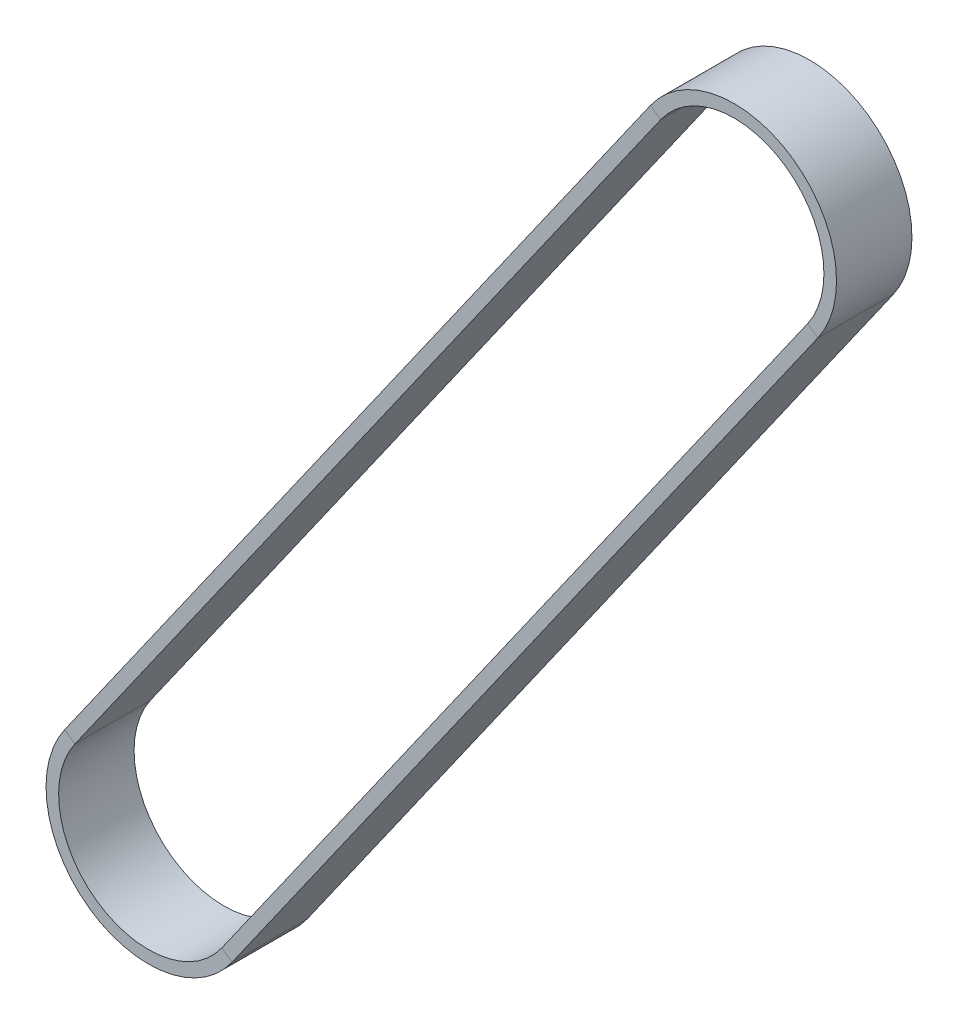
ISO-10303-21;
HEADER;
FILE_DESCRIPTION(('STEP AP214'),'2;1');
FILE_NAME('part.step','',(''),(''),'','','');
FILE_SCHEMA(('AUTOMOTIVE_DESIGN { 1 0 10303 214 1 1 1 1 }'));
ENDSEC;
DATA;
#1=APPLICATION_CONTEXT('core data for automotive mechanical design processes');
#2=APPLICATION_PROTOCOL_DEFINITION('international standard','automotive_design',2000,#1);
#3=PRODUCT_CONTEXT('',#1,'mechanical');
#4=PRODUCT('Part','Part','',(#3));
#5=PRODUCT_RELATED_PRODUCT_CATEGORY('part','',(#4));
#6=PRODUCT_DEFINITION_FORMATION('','',#4);
#7=PRODUCT_DEFINITION_CONTEXT('part definition',#1,'design');
#8=PRODUCT_DEFINITION('design','',#6,#7);
#9=PRODUCT_DEFINITION_SHAPE('','',#8);
#10=(LENGTH_UNIT() NAMED_UNIT(*) SI_UNIT(.MILLI.,.METRE.));
#11=(NAMED_UNIT(*) PLANE_ANGLE_UNIT() SI_UNIT($,.RADIAN.));
#12=(NAMED_UNIT(*) SI_UNIT($,.STERADIAN.) SOLID_ANGLE_UNIT());
#13=UNCERTAINTY_MEASURE_WITH_UNIT(LENGTH_MEASURE(1.E-05),#10,'distance_accuracy_value','');
#14=(GEOMETRIC_REPRESENTATION_CONTEXT(3) GLOBAL_UNCERTAINTY_ASSIGNED_CONTEXT((#13)) GLOBAL_UNIT_ASSIGNED_CONTEXT((#10,
#11,#12)) REPRESENTATION_CONTEXT('',''));
#15=CARTESIAN_POINT('',(0.,0.,0.));
#16=DIRECTION('',(0.,0.,1.));
#17=DIRECTION('',(1.,0.,0.));
#18=AXIS2_PLACEMENT_3D('',#15,#16,#17);
#19=CARTESIAN_POINT('',(-81.6871696400104,-84.9175972484499,4.50000000000002));
#20=DIRECTION('',(0.,0.,1.));
#21=DIRECTION('',(1.,0.,0.));
#22=AXIS2_PLACEMENT_3D('',#19,#20,#21);
#23=PLANE('',#22);
#24=DIRECTION('',(0.575005551879474,0.818149506696534,0.));
#25=VECTOR('',#24,1.);
#26=CARTESIAN_POINT('',(-82.9143939000552,-84.0550889206307,4.50000000000002));
#27=LINE('',#26,#25);
#28=CARTESIAN_POINT('',(-82.9143939000552,-84.0550889206307,4.50000000000002));
#29=VERTEX_POINT('',#28);
#30=CARTESIAN_POINT('',(-13.0390177288961,15.367437275519,4.50000000000002));
#31=VERTEX_POINT('',#30);
#32=EDGE_CURVE('E11',#29,#31,#27,.T.);
#33=ORIENTED_EDGE('',*,*,#32,.F.);
#34=DIRECTION('',(0.818149506696534,-0.575005551879474,0.));
#35=VECTOR('',#34,1.);
#36=CARTESIAN_POINT('',(-81.6871696400104,-84.9175972484499,4.50000000000002));
#37=LINE('',#36,#35);
#38=CARTESIAN_POINT('',(-81.6871696400104,-84.9175972484499,4.50000000000002));
#39=VERTEX_POINT('',#38);
#40=EDGE_CURVE('E42',#29,#39,#37,.T.);
#41=ORIENTED_EDGE('',*,*,#40,.T.);
#42=DIRECTION('',(0.575005551879474,0.818149506696534,0.));
#43=VECTOR('',#42,1.);
#44=CARTESIAN_POINT('',(-81.6871696400104,-84.9175972484499,4.50000000000002));
#45=LINE('',#44,#43);
#46=CARTESIAN_POINT('',(-11.8117934688513,14.5049289476998,4.50000000000002));
#47=VERTEX_POINT('',#46);
#48=EDGE_CURVE('E128',#39,#47,#45,.T.);
#49=ORIENTED_EDGE('',*,*,#48,.T.);
#50=DIRECTION('',(0.818149506696534,-0.575005551879474,0.));
#51=VECTOR('',#50,1.);
#52=CARTESIAN_POINT('',(-11.8117934688513,14.5049289476998,4.50000000000002));
#53=LINE('',#52,#51);
#54=EDGE_CURVE('E131',#31,#47,#53,.T.);
#55=ORIENTED_EDGE('',*,*,#54,.F.);
#56=EDGE_LOOP('',(#33,#41,#49,#55));
#57=FACE_BOUND('',#56,.T.);
#58=ADVANCED_FACE('F39',(#57),#23,.T.);
#59=CARTESIAN_POINT('',(-82.9143939000552,-84.0550889206307,4.50000000000002));
#60=DIRECTION('',(-0.818149506696534,0.575005551879474,0.));
#61=DIRECTION('',(-0.575005551879474,-0.818149506696534,0.));
#62=AXIS2_PLACEMENT_3D('',#59,#60,#61);
#63=PLANE('',#62);
#64=DIRECTION('',(0.575005551879474,0.818149506696534,0.));
#65=VECTOR('',#64,1.);
#66=CARTESIAN_POINT('',(-82.9143939000552,-84.0550889206307,-4.49999999999998));
#67=LINE('',#66,#65);
#68=CARTESIAN_POINT('',(-82.9143939000552,-84.0550889206307,-4.49999999999998));
#69=VERTEX_POINT('',#68);
#70=CARTESIAN_POINT('',(-13.0390177288961,15.367437275519,-4.49999999999998));
#71=VERTEX_POINT('',#70);
#72=EDGE_CURVE('E48',#69,#71,#67,.T.);
#73=ORIENTED_EDGE('',*,*,#72,.F.);
#74=DIRECTION('',(0.,0.,1.));
#75=VECTOR('',#74,1.);
#76=CARTESIAN_POINT('',(-82.9143939000552,-84.0550889206307,4.50000000000002));
#77=LINE('',#76,#75);
#78=EDGE_CURVE('E218',#69,#29,#77,.T.);
#79=ORIENTED_EDGE('',*,*,#78,.T.);
#80=ORIENTED_EDGE('',*,*,#32,.T.);
#81=DIRECTION('',(0.,0.,1.));
#82=VECTOR('',#81,1.);
#83=CARTESIAN_POINT('',(-13.0390177288961,15.367437275519,4.50000000000002));
#84=LINE('',#83,#82);
#85=EDGE_CURVE('E159',#71,#31,#84,.T.);
#86=ORIENTED_EDGE('',*,*,#85,.F.);
#87=EDGE_LOOP('',(#73,#79,#80,#86));
#88=FACE_BOUND('',#87,.T.);
#89=ADVANCED_FACE('F252',(#88),#63,.T.);
#90=CARTESIAN_POINT('',(-81.6871696400104,-84.9175972484499,-4.49999999999998));
#91=DIRECTION('',(0.,0.,-1.));
#92=DIRECTION('',(-1.,0.,0.));
#93=AXIS2_PLACEMENT_3D('',#90,#91,#92);
#94=PLANE('',#93);
#95=DIRECTION('',(0.575005551879474,0.818149506696534,0.));
#96=VECTOR('',#95,1.);
#97=CARTESIAN_POINT('',(-81.6871696400104,-84.9175972484499,-4.49999999999998));
#98=LINE('',#97,#96);
#99=CARTESIAN_POINT('',(-81.6871696400104,-84.9175972484499,-4.49999999999998));
#100=VERTEX_POINT('',#99);
#101=CARTESIAN_POINT('',(-11.8117934688513,14.5049289476998,-4.49999999999998));
#102=VERTEX_POINT('',#101);
#103=EDGE_CURVE('E138',#100,#102,#98,.T.);
#104=ORIENTED_EDGE('',*,*,#103,.F.);
#105=DIRECTION('',(-0.818149506696533,0.575005551879475,0.));
#106=VECTOR('',#105,1.);
#107=CARTESIAN_POINT('',(-81.6871696400104,-84.9175972484499,-4.49999999999998));
#108=LINE('',#107,#106);
#109=EDGE_CURVE('E194',#100,#69,#108,.T.);
#110=ORIENTED_EDGE('',*,*,#109,.T.);
#111=ORIENTED_EDGE('',*,*,#72,.T.);
#112=DIRECTION('',(-0.818149506696533,0.575005551879475,0.));
#113=VECTOR('',#112,1.);
#114=CARTESIAN_POINT('',(-11.8117934688513,14.5049289476998,-4.49999999999998));
#115=LINE('',#114,#113);
#116=EDGE_CURVE('E164',#102,#71,#115,.T.);
#117=ORIENTED_EDGE('',*,*,#116,.F.);
#118=EDGE_LOOP('',(#104,#110,#111,#117));
#119=FACE_BOUND('',#118,.T.);
#120=ADVANCED_FACE('F257',(#119),#94,.T.);
#121=CARTESIAN_POINT('',(-64.1699341820323,-97.2289261186309,4.50000000000002));
#122=DIRECTION('',(0.,0.,1.));
#123=DIRECTION('',(1.,0.,0.));
#124=AXIS2_PLACEMENT_3D('',#121,#122,#123);
#125=PLANE('',#124);
#126=ORIENTED_EDGE('',*,*,#40,.F.);
#127=CARTESIAN_POINT('',(-72.9285519110213,-91.0732616835404,4.50000000000002));
#128=DIRECTION('',(0.,0.,-1.));
#129=DIRECTION('',(0.818149506696534,-0.575005551879474,0.));
#130=AXIS2_PLACEMENT_3D('',#127,#128,#129);
#131=CIRCLE('',#130,12.2054);
#132=CARTESIAN_POINT('',(-62.9427099219874,-98.0914344464501,4.50000000000002));
#133=VERTEX_POINT('',#132);
#134=EDGE_CURVE('E84',#133,#29,#131,.T.);
#135=ORIENTED_EDGE('',*,*,#134,.F.);
#136=DIRECTION('',(-0.818149506696534,0.575005551879474,0.));
#137=VECTOR('',#136,1.);
#138=CARTESIAN_POINT('',(-64.1699341820322,-97.2289261186309,4.50000000000002));
#139=LINE('',#138,#137);
#140=CARTESIAN_POINT('',(-64.1699341820322,-97.2289261186309,4.50000000000002));
#141=VERTEX_POINT('',#140);
#142=EDGE_CURVE('E198',#133,#141,#139,.T.);
#143=ORIENTED_EDGE('',*,*,#142,.T.);
#144=CARTESIAN_POINT('',(-72.9285519110213,-91.0732616835404,4.50000000000002));
#145=DIRECTION('',(0.,0.,-1.));
#146=DIRECTION('',(0.818149506696533,-0.575005551879475,0.));
#147=AXIS2_PLACEMENT_3D('',#144,#145,#146);
#148=CIRCLE('',#147,10.7054);
#149=EDGE_CURVE('E191',#141,#39,#148,.T.);
#150=ORIENTED_EDGE('',*,*,#149,.T.);
#151=EDGE_LOOP('',(#126,#135,#143,#150));
#152=FACE_BOUND('',#151,.T.);
#153=ADVANCED_FACE('F241',(#152),#125,.T.);
#154=CARTESIAN_POINT('',(-72.9285519110213,-91.0732616835404,0.));
#155=DIRECTION('',(0.,0.,-1.));
#156=DIRECTION('',(-1.,0.,0.));
#157=AXIS2_PLACEMENT_3D('',#154,#155,#156);
#158=CYLINDRICAL_SURFACE('',#157,12.2054);
#159=ORIENTED_EDGE('',*,*,#134,.T.);
#160=ORIENTED_EDGE('',*,*,#78,.F.);
#161=CARTESIAN_POINT('',(-72.9285519110213,-91.0732616835404,-4.49999999999998));
#162=DIRECTION('',(0.,0.,-1.));
#163=DIRECTION('',(0.818149506696533,-0.575005551879475,0.));
#164=AXIS2_PLACEMENT_3D('',#161,#162,#163);
#165=CIRCLE('',#164,12.2054);
#166=CARTESIAN_POINT('',(-62.9427099219874,-98.0914344464501,-4.49999999999998));
#167=VERTEX_POINT('',#166);
#168=EDGE_CURVE('E93',#167,#69,#165,.T.);
#169=ORIENTED_EDGE('',*,*,#168,.F.);
#170=DIRECTION('',(0.,0.,1.));
#171=VECTOR('',#170,1.);
#172=CARTESIAN_POINT('',(-62.9427099219874,-98.0914344464501,4.50000000000002));
#173=LINE('',#172,#171);
#174=EDGE_CURVE('E212',#167,#133,#173,.T.);
#175=ORIENTED_EDGE('',*,*,#174,.T.);
#176=EDGE_LOOP('',(#159,#160,#169,#175));
#177=FACE_BOUND('',#176,.T.);
#178=ADVANCED_FACE('F251',(#177),#158,.T.);
#179=CARTESIAN_POINT('',(-64.1699341820323,-97.2289261186309,-4.49999999999998));
#180=DIRECTION('',(0.,0.,-1.));
#181=DIRECTION('',(-1.,0.,0.));
#182=AXIS2_PLACEMENT_3D('',#179,#180,#181);
#183=PLANE('',#182);
#184=ORIENTED_EDGE('',*,*,#168,.T.);
#185=ORIENTED_EDGE('',*,*,#109,.F.);
#186=CARTESIAN_POINT('',(-72.9285519110213,-91.0732616835404,-4.49999999999998));
#187=DIRECTION('',(0.,0.,-1.));
#188=DIRECTION('',(0.818149506696533,-0.575005551879475,0.));
#189=AXIS2_PLACEMENT_3D('',#186,#187,#188);
#190=CIRCLE('',#189,10.7054);
#191=CARTESIAN_POINT('',(-64.1699341820322,-97.2289261186309,-4.49999999999998));
#192=VERTEX_POINT('',#191);
#193=EDGE_CURVE('E101',#192,#100,#190,.T.);
#194=ORIENTED_EDGE('',*,*,#193,.F.);
#195=DIRECTION('',(0.818149506696533,-0.575005551879475,0.));
#196=VECTOR('',#195,1.);
#197=CARTESIAN_POINT('',(-64.1699341820322,-97.2289261186309,-4.49999999999998));
#198=LINE('',#197,#196);
#199=EDGE_CURVE('E183',#192,#167,#198,.T.);
#200=ORIENTED_EDGE('',*,*,#199,.T.);
#201=EDGE_LOOP('',(#184,#185,#194,#200));
#202=FACE_BOUND('',#201,.T.);
#203=ADVANCED_FACE('F258',(#202),#183,.T.);
#204=CARTESIAN_POINT('',(-72.9285519110213,-91.0732616835404,0.));
#205=DIRECTION('',(0.,0.,-1.));
#206=DIRECTION('',(-1.,0.,0.));
#207=AXIS2_PLACEMENT_3D('',#204,#205,#206);
#208=CYLINDRICAL_SURFACE('',#207,10.7054);
#209=ORIENTED_EDGE('',*,*,#193,.T.);
#210=DIRECTION('',(0.,0.,-1.));
#211=VECTOR('',#210,1.);
#212=CARTESIAN_POINT('',(-81.6871696400104,-84.9175972484499,4.50000000000002));
#213=LINE('',#212,#211);
#214=EDGE_CURVE('E188',#39,#100,#213,.T.);
#215=ORIENTED_EDGE('',*,*,#214,.F.);
#216=ORIENTED_EDGE('',*,*,#149,.F.);
#217=DIRECTION('',(0.,0.,-1.));
#218=VECTOR('',#217,1.);
#219=CARTESIAN_POINT('',(-64.1699341820322,-97.2289261186309,4.50000000000002));
#220=LINE('',#219,#218);
#221=EDGE_CURVE('E176',#141,#192,#220,.T.);
#222=ORIENTED_EDGE('',*,*,#221,.T.);
#223=EDGE_LOOP('',(#209,#215,#216,#222));
#224=FACE_BOUND('',#223,.T.);
#225=ADVANCED_FACE('F259',(#224),#208,.F.);
#226=CARTESIAN_POINT('',(5.70544198912682,2.19360007751873,4.50000000000002));
#227=DIRECTION('',(0.,0.,1.));
#228=DIRECTION('',(1.,0.,0.));
#229=AXIS2_PLACEMENT_3D('',#226,#227,#228);
#230=PLANE('',#229);
#231=ORIENTED_EDGE('',*,*,#142,.F.);
#232=DIRECTION('',(-0.575005551879474,-0.818149506696534,0.));
#233=VECTOR('',#232,1.);
#234=CARTESIAN_POINT('',(6.93266624917162,1.33109174969952,4.50000000000002));
#235=LINE('',#234,#233);
#236=CARTESIAN_POINT('',(6.93266624917162,1.33109174969952,4.50000000000002));
#237=VERTEX_POINT('',#236);
#238=EDGE_CURVE('E229',#237,#133,#235,.T.);
#239=ORIENTED_EDGE('',*,*,#238,.F.);
#240=DIRECTION('',(-0.818149506696534,0.575005551879474,0.));
#241=VECTOR('',#240,1.);
#242=CARTESIAN_POINT('',(5.70544198912682,2.19360007751874,4.50000000000002));
#243=LINE('',#242,#241);
#244=CARTESIAN_POINT('',(5.70544198912682,2.19360007751873,4.50000000000002));
#245=VERTEX_POINT('',#244);
#246=EDGE_CURVE('E187',#237,#245,#243,.T.);
#247=ORIENTED_EDGE('',*,*,#246,.T.);
#248=DIRECTION('',(-0.575005551879474,-0.818149506696534,0.));
#249=VECTOR('',#248,1.);
#250=CARTESIAN_POINT('',(5.70544198912682,2.19360007751873,4.50000000000002));
#251=LINE('',#250,#249);
#252=EDGE_CURVE('E180',#245,#141,#251,.T.);
#253=ORIENTED_EDGE('',*,*,#252,.T.);
#254=EDGE_LOOP('',(#231,#239,#247,#253));
#255=FACE_BOUND('',#254,.T.);
#256=ADVANCED_FACE('F246',(#255),#230,.T.);
#257=CARTESIAN_POINT('',(6.93266624917162,1.33109174969952,4.50000000000002));
#258=DIRECTION('',(0.818149506696534,-0.575005551879474,0.));
#259=DIRECTION('',(0.575005551879474,0.818149506696534,0.));
#260=AXIS2_PLACEMENT_3D('',#257,#258,#259);
#261=PLANE('',#260);
#262=ORIENTED_EDGE('',*,*,#238,.T.);
#263=ORIENTED_EDGE('',*,*,#174,.F.);
#264=DIRECTION('',(-0.575005551879474,-0.818149506696534,0.));
#265=VECTOR('',#264,1.);
#266=CARTESIAN_POINT('',(6.93266624917163,1.33109174969952,-4.49999999999998));
#267=LINE('',#266,#265);
#268=CARTESIAN_POINT('',(6.93266624917162,1.33109174969952,-4.49999999999998));
#269=VERTEX_POINT('',#268);
#270=EDGE_CURVE('E113',#269,#167,#267,.T.);
#271=ORIENTED_EDGE('',*,*,#270,.F.);
#272=DIRECTION('',(0.,0.,1.));
#273=VECTOR('',#272,1.);
#274=CARTESIAN_POINT('',(6.93266624917162,1.33109174969952,4.50000000000002));
#275=LINE('',#274,#273);
#276=EDGE_CURVE('E207',#269,#237,#275,.T.);
#277=ORIENTED_EDGE('',*,*,#276,.T.);
#278=EDGE_LOOP('',(#262,#263,#271,#277));
#279=FACE_BOUND('',#278,.T.);
#280=ADVANCED_FACE('F250',(#279),#261,.T.);
#281=CARTESIAN_POINT('',(5.70544198912682,2.19360007751873,-4.49999999999998));
#282=DIRECTION('',(0.,0.,-1.));
#283=DIRECTION('',(-1.,0.,0.));
#284=AXIS2_PLACEMENT_3D('',#281,#282,#283);
#285=PLANE('',#284);
#286=ORIENTED_EDGE('',*,*,#270,.T.);
#287=ORIENTED_EDGE('',*,*,#199,.F.);
#288=DIRECTION('',(-0.575005551879474,-0.818149506696534,0.));
#289=VECTOR('',#288,1.);
#290=CARTESIAN_POINT('',(5.70544198912682,2.19360007751873,-4.49999999999998));
#291=LINE('',#290,#289);
#292=CARTESIAN_POINT('',(5.70544198912682,2.19360007751873,-4.49999999999998));
#293=VERTEX_POINT('',#292);
#294=EDGE_CURVE('E119',#293,#192,#291,.T.);
#295=ORIENTED_EDGE('',*,*,#294,.F.);
#296=DIRECTION('',(0.818149506696534,-0.575005551879475,0.));
#297=VECTOR('',#296,1.);
#298=CARTESIAN_POINT('',(5.70544198912682,2.19360007751874,-4.49999999999998));
#299=LINE('',#298,#297);
#300=EDGE_CURVE('E174',#293,#269,#299,.T.);
#301=ORIENTED_EDGE('',*,*,#300,.T.);
#302=EDGE_LOOP('',(#286,#287,#295,#301));
#303=FACE_BOUND('',#302,.T.);
#304=ADVANCED_FACE('F312',(#303),#285,.T.);
#305=CARTESIAN_POINT('',(5.70544198912682,2.19360007751873,4.50000000000002));
#306=DIRECTION('',(-0.818149506696534,0.575005551879474,0.));
#307=DIRECTION('',(-0.575005551879474,-0.818149506696534,0.));
#308=AXIS2_PLACEMENT_3D('',#305,#306,#307);
#309=PLANE('',#308);
#310=ORIENTED_EDGE('',*,*,#294,.T.);
#311=ORIENTED_EDGE('',*,*,#221,.F.);
#312=ORIENTED_EDGE('',*,*,#252,.F.);
#313=DIRECTION('',(0.,0.,-1.));
#314=VECTOR('',#313,1.);
#315=CARTESIAN_POINT('',(5.70544198912682,2.19360007751874,4.50000000000002));
#316=LINE('',#315,#314);
#317=EDGE_CURVE('E149',#245,#293,#316,.T.);
#318=ORIENTED_EDGE('',*,*,#317,.T.);
#319=EDGE_LOOP('',(#310,#311,#312,#318));
#320=FACE_BOUND('',#319,.T.);
#321=ADVANCED_FACE('F244',(#320),#309,.T.);
#322=CARTESIAN_POINT('',(-11.8117934688513,14.5049289476998,4.50000000000002));
#323=DIRECTION('',(0.,0.,1.));
#324=DIRECTION('',(1.,0.,0.));
#325=AXIS2_PLACEMENT_3D('',#322,#323,#324);
#326=PLANE('',#325);
#327=ORIENTED_EDGE('',*,*,#246,.F.);
#328=CARTESIAN_POINT('',(-3.05317573986225,8.34926451260926,4.50000000000002));
#329=DIRECTION('',(0.,0.,-1.));
#330=DIRECTION('',(-0.818149506696534,0.575005551879474,0.));
#331=AXIS2_PLACEMENT_3D('',#328,#329,#330);
#332=CIRCLE('',#331,12.2054);
#333=EDGE_CURVE('E157',#31,#237,#332,.T.);
#334=ORIENTED_EDGE('',*,*,#333,.F.);
#335=ORIENTED_EDGE('',*,*,#54,.T.);
#336=CARTESIAN_POINT('',(-3.05317573986225,8.34926451260926,4.50000000000002));
#337=DIRECTION('',(0.,0.,-1.));
#338=DIRECTION('',(-0.818149506696534,0.575005551879474,0.));
#339=AXIS2_PLACEMENT_3D('',#336,#337,#338);
#340=CIRCLE('',#339,10.7054);
#341=EDGE_CURVE('E144',#47,#245,#340,.T.);
#342=ORIENTED_EDGE('',*,*,#341,.T.);
#343=EDGE_LOOP('',(#327,#334,#335,#342));
#344=FACE_BOUND('',#343,.T.);
#345=ADVANCED_FACE('F155',(#344),#326,.T.);
#346=CARTESIAN_POINT('',(-3.05317573986225,8.34926451260926,0.));
#347=DIRECTION('',(0.,0.,-1.));
#348=DIRECTION('',(-1.,0.,0.));
#349=AXIS2_PLACEMENT_3D('',#346,#347,#348);
#350=CYLINDRICAL_SURFACE('',#349,12.2054);
#351=ORIENTED_EDGE('',*,*,#333,.T.);
#352=ORIENTED_EDGE('',*,*,#276,.F.);
#353=CARTESIAN_POINT('',(-3.05317573986225,8.34926451260926,-4.49999999999998));
#354=DIRECTION('',(0.,0.,-1.));
#355=DIRECTION('',(-0.818149506696533,0.575005551879474,0.));
#356=AXIS2_PLACEMENT_3D('',#353,#354,#355);
#357=CIRCLE('',#356,12.2054);
#358=EDGE_CURVE('E203',#71,#269,#357,.T.);
#359=ORIENTED_EDGE('',*,*,#358,.F.);
#360=ORIENTED_EDGE('',*,*,#85,.T.);
#361=EDGE_LOOP('',(#351,#352,#359,#360));
#362=FACE_BOUND('',#361,.T.);
#363=ADVANCED_FACE('F248',(#362),#350,.T.);
#364=CARTESIAN_POINT('',(-11.8117934688513,14.5049289476998,-4.49999999999998));
#365=DIRECTION('',(0.,0.,-1.));
#366=DIRECTION('',(-1.,0.,0.));
#367=AXIS2_PLACEMENT_3D('',#364,#365,#366);
#368=PLANE('',#367);
#369=ORIENTED_EDGE('',*,*,#358,.T.);
#370=ORIENTED_EDGE('',*,*,#300,.F.);
#371=CARTESIAN_POINT('',(-3.05317573986225,8.34926451260926,-4.49999999999998));
#372=DIRECTION('',(0.,0.,-1.));
#373=DIRECTION('',(-0.818149506696534,0.575005551879474,0.));
#374=AXIS2_PLACEMENT_3D('',#371,#372,#373);
#375=CIRCLE('',#374,10.7054);
#376=EDGE_CURVE('E172',#102,#293,#375,.T.);
#377=ORIENTED_EDGE('',*,*,#376,.F.);
#378=ORIENTED_EDGE('',*,*,#116,.T.);
#379=EDGE_LOOP('',(#369,#370,#377,#378));
#380=FACE_BOUND('',#379,.T.);
#381=ADVANCED_FACE('F255',(#380),#368,.T.);
#382=CARTESIAN_POINT('',(-3.05317573986225,8.34926451260926,0.));
#383=DIRECTION('',(0.,0.,-1.));
#384=DIRECTION('',(-1.,0.,0.));
#385=AXIS2_PLACEMENT_3D('',#382,#383,#384);
#386=CYLINDRICAL_SURFACE('',#385,10.7054);
#387=ORIENTED_EDGE('',*,*,#376,.T.);
#388=ORIENTED_EDGE('',*,*,#317,.F.);
#389=ORIENTED_EDGE('',*,*,#341,.F.);
#390=DIRECTION('',(0.,0.,-1.));
#391=VECTOR('',#390,1.);
#392=CARTESIAN_POINT('',(-11.8117934688513,14.5049289476998,4.50000000000002));
#393=LINE('',#392,#391);
#394=EDGE_CURVE('E147',#47,#102,#393,.T.);
#395=ORIENTED_EDGE('',*,*,#394,.T.);
#396=EDGE_LOOP('',(#387,#388,#389,#395));
#397=FACE_BOUND('',#396,.T.);
#398=ADVANCED_FACE('F146',(#397),#386,.F.);
#399=CARTESIAN_POINT('',(-81.6871696400104,-84.9175972484499,4.50000000000002));
#400=DIRECTION('',(0.818149506696534,-0.575005551879474,0.));
#401=DIRECTION('',(0.575005551879474,0.818149506696534,0.));
#402=AXIS2_PLACEMENT_3D('',#399,#400,#401);
#403=PLANE('',#402);
#404=ORIENTED_EDGE('',*,*,#214,.T.);
#405=ORIENTED_EDGE('',*,*,#103,.T.);
#406=ORIENTED_EDGE('',*,*,#394,.F.);
#407=ORIENTED_EDGE('',*,*,#48,.F.);
#408=EDGE_LOOP('',(#404,#405,#406,#407));
#409=FACE_BOUND('',#408,.T.);
#410=ADVANCED_FACE('F161',(#409),#403,.T.);
#411=CLOSED_SHELL('',(#58,#89,#120,#153,#178,#203,#225,#256,#280,#304,#321,#345,#363,#381,#398,#410));
#412=MANIFOLD_SOLID_BREP('B2',#411);
#413=ADVANCED_BREP_SHAPE_REPRESENTATION('',(#18,#412),#14);
#414=SHAPE_DEFINITION_REPRESENTATION(#9,#413);
ENDSEC;
END-ISO-10303-21;
